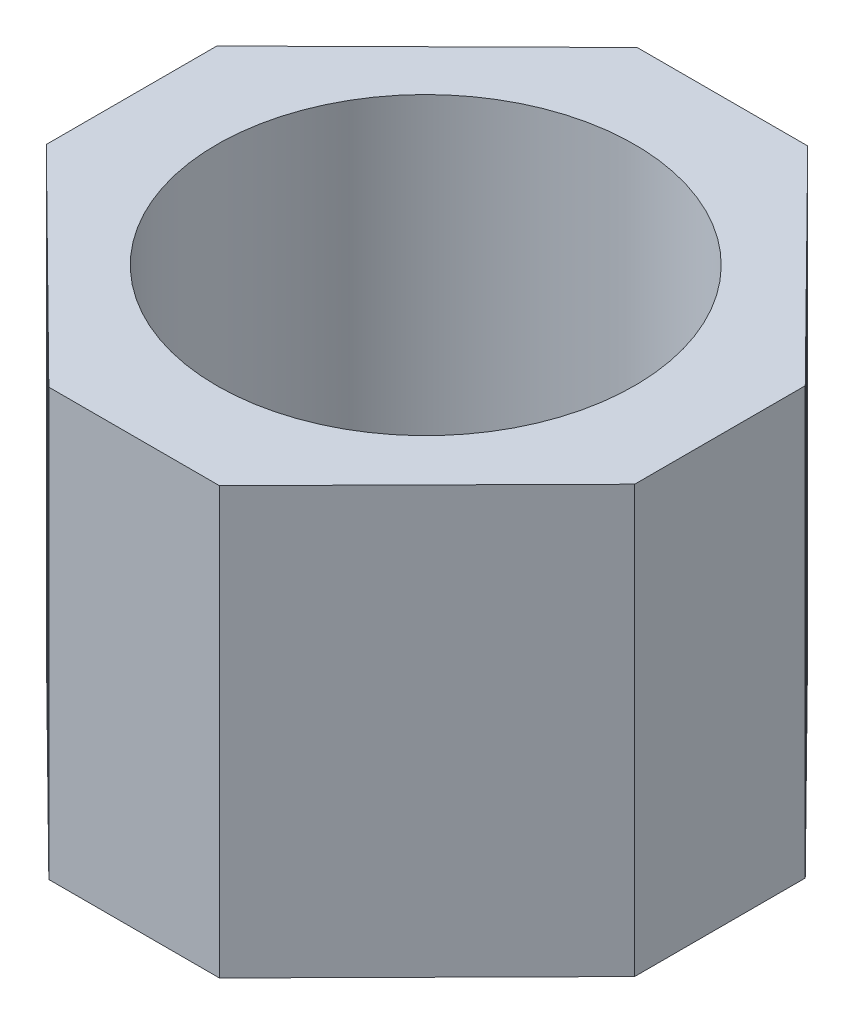
ISO-10303-21;
HEADER;
FILE_DESCRIPTION(('STEP AP214'),'2;1');
FILE_NAME('part.step','',(''),(''),'','','');
FILE_SCHEMA(('AUTOMOTIVE_DESIGN { 1 0 10303 214 1 1 1 1 }'));
ENDSEC;
DATA;
#1=APPLICATION_CONTEXT('core data for automotive mechanical design processes');
#2=APPLICATION_PROTOCOL_DEFINITION('international standard','automotive_design',2000,#1);
#3=PRODUCT_CONTEXT('',#1,'mechanical');
#4=PRODUCT('Part','Part','',(#3));
#5=PRODUCT_RELATED_PRODUCT_CATEGORY('part','',(#4));
#6=PRODUCT_DEFINITION_FORMATION('','',#4);
#7=PRODUCT_DEFINITION_CONTEXT('part definition',#1,'design');
#8=PRODUCT_DEFINITION('design','',#6,#7);
#9=PRODUCT_DEFINITION_SHAPE('','',#8);
#10=(LENGTH_UNIT() NAMED_UNIT(*) SI_UNIT(.MILLI.,.METRE.));
#11=(NAMED_UNIT(*) PLANE_ANGLE_UNIT() SI_UNIT($,.RADIAN.));
#12=(NAMED_UNIT(*) SI_UNIT($,.STERADIAN.) SOLID_ANGLE_UNIT());
#13=UNCERTAINTY_MEASURE_WITH_UNIT(LENGTH_MEASURE(1.E-05),#10,'distance_accuracy_value','');
#14=(GEOMETRIC_REPRESENTATION_CONTEXT(3) GLOBAL_UNCERTAINTY_ASSIGNED_CONTEXT((#13)) GLOBAL_UNIT_ASSIGNED_CONTEXT((#10,
#11,#12)) REPRESENTATION_CONTEXT('',''));
#15=CARTESIAN_POINT('',(0.,0.,0.));
#16=DIRECTION('',(0.,0.,1.));
#17=DIRECTION('',(1.,0.,0.));
#18=AXIS2_PLACEMENT_3D('',#15,#16,#17);
#19=CARTESIAN_POINT('',(3.45,5.,0.));
#20=DIRECTION('',(-1.,0.,0.));
#21=DIRECTION('',(0.,0.,1.));
#22=AXIS2_PLACEMENT_3D('',#19,#20,#21);
#23=PLANE('',#22);
#24=DIRECTION('',(0.,0.,-1.));
#25=VECTOR('',#24,1.);
#26=CARTESIAN_POINT('',(3.45,0.,0.));
#27=LINE('',#26,#25);
#28=CARTESIAN_POINT('',(3.45,0.,1.));
#29=VERTEX_POINT('',#28);
#30=CARTESIAN_POINT('',(3.45,0.,-1.));
#31=VERTEX_POINT('',#30);
#32=EDGE_CURVE('E134',#29,#31,#27,.T.);
#33=ORIENTED_EDGE('',*,*,#32,.T.);
#34=DIRECTION('',(0.,-1.,0.));
#35=VECTOR('',#34,1.);
#36=CARTESIAN_POINT('',(3.45,5.,-1.));
#37=LINE('',#36,#35);
#38=CARTESIAN_POINT('',(3.45,5.,-1.));
#39=VERTEX_POINT('',#38);
#40=EDGE_CURVE('E11',#39,#31,#37,.T.);
#41=ORIENTED_EDGE('',*,*,#40,.F.);
#42=DIRECTION('',(0.,0.,-1.));
#43=VECTOR('',#42,1.);
#44=CARTESIAN_POINT('',(3.45,5.,0.));
#45=LINE('',#44,#43);
#46=CARTESIAN_POINT('',(3.45,5.,1.));
#47=VERTEX_POINT('',#46);
#48=EDGE_CURVE('E183',#47,#39,#45,.T.);
#49=ORIENTED_EDGE('',*,*,#48,.F.);
#50=DIRECTION('',(0.,-1.,0.));
#51=VECTOR('',#50,1.);
#52=CARTESIAN_POINT('',(3.45,5.,1.));
#53=LINE('',#52,#51);
#54=EDGE_CURVE('E127',#47,#29,#53,.T.);
#55=ORIENTED_EDGE('',*,*,#54,.T.);
#56=EDGE_LOOP('',(#33,#41,#49,#55));
#57=FACE_BOUND('',#56,.T.);
#58=ADVANCED_FACE('F35',(#57),#23,.F.);
#59=CARTESIAN_POINT('',(2.24576253721168,5.,-2.21884594418373));
#60=DIRECTION('',(-0.711356915918418,0.,0.702830945658369));
#61=DIRECTION('',(0.702830945658369,0.,0.711356915918418));
#62=AXIS2_PLACEMENT_3D('',#59,#60,#61);
#63=PLANE('',#62);
#64=DIRECTION('',(-0.702830945658369,0.,-0.711356915918418));
#65=VECTOR('',#64,1.);
#66=CARTESIAN_POINT('',(2.24576253721168,0.,-2.21884594418373));
#67=LINE('',#66,#65);
#68=CARTESIAN_POINT('',(1.02980337680468,0.,-3.44955578070013));
#69=VERTEX_POINT('',#68);
#70=EDGE_CURVE('E137',#31,#69,#67,.T.);
#71=ORIENTED_EDGE('',*,*,#70,.T.);
#72=DIRECTION('',(0.,-1.,0.));
#73=VECTOR('',#72,1.);
#74=CARTESIAN_POINT('',(1.02980337680468,5.,-3.44955578070013));
#75=LINE('',#74,#73);
#76=CARTESIAN_POINT('',(1.02980337680468,5.,-3.44955578070013));
#77=VERTEX_POINT('',#76);
#78=EDGE_CURVE('E44',#77,#69,#75,.T.);
#79=ORIENTED_EDGE('',*,*,#78,.F.);
#80=DIRECTION('',(-0.702830945658369,0.,-0.711356915918418));
#81=VECTOR('',#80,1.);
#82=CARTESIAN_POINT('',(2.24576253721168,5.,-2.21884594418373));
#83=LINE('',#82,#81);
#84=EDGE_CURVE('E91',#39,#77,#83,.T.);
#85=ORIENTED_EDGE('',*,*,#84,.F.);
#86=ORIENTED_EDGE('',*,*,#40,.T.);
#87=EDGE_LOOP('',(#71,#79,#85,#86));
#88=FACE_BOUND('',#87,.T.);
#89=ADVANCED_FACE('F165',(#88),#63,.F.);
#90=CARTESIAN_POINT('',(0.,5.,-3.44955578070013));
#91=DIRECTION('',(0.,0.,-1.));
#92=DIRECTION('',(-1.,0.,0.));
#93=AXIS2_PLACEMENT_3D('',#90,#91,#92);
#94=PLANE('',#93);
#95=DIRECTION('',(1.,0.,0.));
#96=VECTOR('',#95,1.);
#97=CARTESIAN_POINT('',(0.,0.,-3.44955578070013));
#98=LINE('',#97,#96);
#99=CARTESIAN_POINT('',(-0.970196623195322,0.,-3.44955578070013));
#100=VERTEX_POINT('',#99);
#101=EDGE_CURVE('E140',#100,#69,#98,.T.);
#102=ORIENTED_EDGE('',*,*,#101,.F.);
#103=DIRECTION('',(0.,-1.,0.));
#104=VECTOR('',#103,1.);
#105=CARTESIAN_POINT('',(-0.970196623195322,5.,-3.44955578070013));
#106=LINE('',#105,#104);
#107=CARTESIAN_POINT('',(-0.970196623195322,5.,-3.44955578070013));
#108=VERTEX_POINT('',#107);
#109=EDGE_CURVE('E158',#108,#100,#106,.T.);
#110=ORIENTED_EDGE('',*,*,#109,.F.);
#111=DIRECTION('',(1.,0.,0.));
#112=VECTOR('',#111,1.);
#113=CARTESIAN_POINT('',(0.,5.,-3.44955578070013));
#114=LINE('',#113,#112);
#115=EDGE_CURVE('E164',#108,#77,#114,.T.);
#116=ORIENTED_EDGE('',*,*,#115,.T.);
#117=ORIENTED_EDGE('',*,*,#78,.T.);
#118=EDGE_LOOP('',(#102,#110,#116,#117));
#119=FACE_BOUND('',#118,.T.);
#120=ADVANCED_FACE('F162',(#119),#94,.T.);
#121=CARTESIAN_POINT('',(-2.20379321169294,5.,-2.23100608330438));
#122=DIRECTION('',(0.702754593276589,0.,0.711432345081847));
#123=DIRECTION('',(0.711432345081847,0.,-0.702754593276589));
#124=AXIS2_PLACEMENT_3D('',#121,#122,#123);
#125=PLANE('',#124);
#126=DIRECTION('',(-0.711432345081847,0.,0.702754593276589));
#127=VECTOR('',#126,1.);
#128=CARTESIAN_POINT('',(-2.20379321169294,0.,-2.23100608330438));
#129=LINE('',#128,#127);
#130=CARTESIAN_POINT('',(-3.45,0.,-1.));
#131=VERTEX_POINT('',#130);
#132=EDGE_CURVE('E143',#100,#131,#129,.T.);
#133=ORIENTED_EDGE('',*,*,#132,.T.);
#134=DIRECTION('',(0.,-1.,0.));
#135=VECTOR('',#134,1.);
#136=CARTESIAN_POINT('',(-3.45,5.,-1.));
#137=LINE('',#136,#135);
#138=CARTESIAN_POINT('',(-3.45,5.,-1.));
#139=VERTEX_POINT('',#138);
#140=EDGE_CURVE('E155',#139,#131,#137,.T.);
#141=ORIENTED_EDGE('',*,*,#140,.F.);
#142=DIRECTION('',(-0.711432345081847,0.,0.702754593276589));
#143=VECTOR('',#142,1.);
#144=CARTESIAN_POINT('',(-2.20379321169294,5.,-2.23100608330438));
#145=LINE('',#144,#143);
#146=EDGE_CURVE('E178',#108,#139,#145,.T.);
#147=ORIENTED_EDGE('',*,*,#146,.F.);
#148=ORIENTED_EDGE('',*,*,#109,.T.);
#149=EDGE_LOOP('',(#133,#141,#147,#148));
#150=FACE_BOUND('',#149,.T.);
#151=ADVANCED_FACE('F174',(#150),#125,.F.);
#152=CARTESIAN_POINT('',(-3.45,5.,0.));
#153=DIRECTION('',(1.,0.,0.));
#154=DIRECTION('',(0.,0.,-1.));
#155=AXIS2_PLACEMENT_3D('',#152,#153,#154);
#156=PLANE('',#155);
#157=DIRECTION('',(0.,0.,1.));
#158=VECTOR('',#157,1.);
#159=CARTESIAN_POINT('',(-3.45,0.,0.));
#160=LINE('',#159,#158);
#161=CARTESIAN_POINT('',(-3.45,0.,1.));
#162=VERTEX_POINT('',#161);
#163=EDGE_CURVE('E145',#131,#162,#160,.T.);
#164=ORIENTED_EDGE('',*,*,#163,.T.);
#165=DIRECTION('',(0.,-1.,0.));
#166=VECTOR('',#165,1.);
#167=CARTESIAN_POINT('',(-3.45,5.,1.));
#168=LINE('',#167,#166);
#169=CARTESIAN_POINT('',(-3.45,5.,1.));
#170=VERTEX_POINT('',#169);
#171=EDGE_CURVE('E123',#170,#162,#168,.T.);
#172=ORIENTED_EDGE('',*,*,#171,.F.);
#173=DIRECTION('',(0.,0.,1.));
#174=VECTOR('',#173,1.);
#175=CARTESIAN_POINT('',(-3.45,5.,0.));
#176=LINE('',#175,#174);
#177=EDGE_CURVE('E110',#139,#170,#176,.T.);
#178=ORIENTED_EDGE('',*,*,#177,.F.);
#179=ORIENTED_EDGE('',*,*,#140,.T.);
#180=EDGE_LOOP('',(#164,#172,#178,#179));
#181=FACE_BOUND('',#180,.T.);
#182=ADVANCED_FACE('F177',(#181),#156,.F.);
#183=CARTESIAN_POINT('',(-2.20379321169294,5.,2.23100608330438));
#184=DIRECTION('',(0.702754593276589,0.,-0.711432345081847));
#185=DIRECTION('',(-0.711432345081847,0.,-0.702754593276589));
#186=AXIS2_PLACEMENT_3D('',#183,#184,#185);
#187=PLANE('',#186);
#188=DIRECTION('',(0.711432345081847,0.,0.702754593276589));
#189=VECTOR('',#188,1.);
#190=CARTESIAN_POINT('',(-2.20379321169294,0.,2.23100608330438));
#191=LINE('',#190,#189);
#192=CARTESIAN_POINT('',(-0.970196623195322,0.,3.44955578070013));
#193=VERTEX_POINT('',#192);
#194=EDGE_CURVE('E119',#162,#193,#191,.T.);
#195=ORIENTED_EDGE('',*,*,#194,.T.);
#196=DIRECTION('',(0.,-1.,0.));
#197=VECTOR('',#196,1.);
#198=CARTESIAN_POINT('',(-0.970196623195322,5.,3.44955578070013));
#199=LINE('',#198,#197);
#200=CARTESIAN_POINT('',(-0.970196623195322,5.,3.44955578070013));
#201=VERTEX_POINT('',#200);
#202=EDGE_CURVE('E116',#201,#193,#199,.T.);
#203=ORIENTED_EDGE('',*,*,#202,.F.);
#204=DIRECTION('',(0.711432345081847,0.,0.702754593276589));
#205=VECTOR('',#204,1.);
#206=CARTESIAN_POINT('',(-2.20379321169294,5.,2.23100608330438));
#207=LINE('',#206,#205);
#208=EDGE_CURVE('E104',#170,#201,#207,.T.);
#209=ORIENTED_EDGE('',*,*,#208,.F.);
#210=ORIENTED_EDGE('',*,*,#171,.T.);
#211=EDGE_LOOP('',(#195,#203,#209,#210));
#212=FACE_BOUND('',#211,.T.);
#213=ADVANCED_FACE('F117',(#212),#187,.F.);
#214=CARTESIAN_POINT('',(0.,5.,3.44955578070013));
#215=DIRECTION('',(0.,0.,1.));
#216=DIRECTION('',(1.,0.,0.));
#217=AXIS2_PLACEMENT_3D('',#214,#215,#216);
#218=PLANE('',#217);
#219=DIRECTION('',(-1.,0.,0.));
#220=VECTOR('',#219,1.);
#221=CARTESIAN_POINT('',(0.,0.,3.44955578070013));
#222=LINE('',#221,#220);
#223=CARTESIAN_POINT('',(1.02980337680468,0.,3.44955578070013));
#224=VERTEX_POINT('',#223);
#225=EDGE_CURVE('E148',#224,#193,#222,.T.);
#226=ORIENTED_EDGE('',*,*,#225,.F.);
#227=DIRECTION('',(0.,-1.,0.));
#228=VECTOR('',#227,1.);
#229=CARTESIAN_POINT('',(1.02980337680468,5.,3.44955578070013));
#230=LINE('',#229,#228);
#231=CARTESIAN_POINT('',(1.02980337680468,5.,3.44955578070013));
#232=VERTEX_POINT('',#231);
#233=EDGE_CURVE('E80',#232,#224,#230,.T.);
#234=ORIENTED_EDGE('',*,*,#233,.F.);
#235=DIRECTION('',(-1.,0.,0.));
#236=VECTOR('',#235,1.);
#237=CARTESIAN_POINT('',(0.,5.,3.44955578070013));
#238=LINE('',#237,#236);
#239=EDGE_CURVE('E108',#232,#201,#238,.T.);
#240=ORIENTED_EDGE('',*,*,#239,.T.);
#241=ORIENTED_EDGE('',*,*,#202,.T.);
#242=EDGE_LOOP('',(#226,#234,#240,#241));
#243=FACE_BOUND('',#242,.T.);
#244=ADVANCED_FACE('F125',(#243),#218,.T.);
#245=CARTESIAN_POINT('',(0.,5.,0.));
#246=DIRECTION('',(0.,-1.,0.));
#247=DIRECTION('',(0.,0.,-1.));
#248=AXIS2_PLACEMENT_3D('',#245,#246,#247);
#249=CYLINDRICAL_SURFACE('',#248,2.45);
#250=CARTESIAN_POINT('',(0.,5.,0.));
#251=DIRECTION('',(0.,1.,0.));
#252=DIRECTION('',(0.,0.,1.));
#253=AXIS2_PLACEMENT_3D('',#250,#251,#252);
#254=CIRCLE('',#253,2.45);
#255=CARTESIAN_POINT('',(0.,5.,2.45));
#256=VERTEX_POINT('',#255);
#257=EDGE_CURVE('E151',#256,#256,#254,.T.);
#258=ORIENTED_EDGE('',*,*,#257,.T.);
#259=EDGE_LOOP('',(#258));
#260=FACE_BOUND('',#259,.T.);
#261=CARTESIAN_POINT('',(0.,0.,0.));
#262=DIRECTION('',(0.,1.,0.));
#263=DIRECTION('',(0.,0.,1.));
#264=AXIS2_PLACEMENT_3D('',#261,#262,#263);
#265=CIRCLE('',#264,2.45);
#266=CARTESIAN_POINT('',(0.,0.,2.45));
#267=VERTEX_POINT('',#266);
#268=EDGE_CURVE('E131',#267,#267,#265,.T.);
#269=ORIENTED_EDGE('',*,*,#268,.F.);
#270=EDGE_LOOP('',(#269));
#271=FACE_BOUND('',#270,.T.);
#272=ADVANCED_FACE('F37',(#260,#271),#249,.F.);
#273=CARTESIAN_POINT('',(2.24576253721169,5.,2.21884594418373));
#274=DIRECTION('',(-0.711356915918418,0.,-0.702830945658369));
#275=DIRECTION('',(-0.702830945658369,0.,0.711356915918418));
#276=AXIS2_PLACEMENT_3D('',#273,#274,#275);
#277=PLANE('',#276);
#278=DIRECTION('',(0.702830945658369,0.,-0.711356915918418));
#279=VECTOR('',#278,1.);
#280=CARTESIAN_POINT('',(2.24576253721169,0.,2.21884594418373));
#281=LINE('',#280,#279);
#282=EDGE_CURVE('E83',#224,#29,#281,.T.);
#283=ORIENTED_EDGE('',*,*,#282,.T.);
#284=ORIENTED_EDGE('',*,*,#54,.F.);
#285=DIRECTION('',(0.702830945658369,0.,-0.711356915918418));
#286=VECTOR('',#285,1.);
#287=CARTESIAN_POINT('',(2.24576253721169,5.,2.21884594418373));
#288=LINE('',#287,#286);
#289=EDGE_CURVE('E52',#232,#47,#288,.T.);
#290=ORIENTED_EDGE('',*,*,#289,.F.);
#291=ORIENTED_EDGE('',*,*,#233,.T.);
#292=EDGE_LOOP('',(#283,#284,#290,#291));
#293=FACE_BOUND('',#292,.T.);
#294=ADVANCED_FACE('F191',(#293),#277,.F.);
#295=CARTESIAN_POINT('',(0.,5.,0.));
#296=DIRECTION('',(0.,1.,0.));
#297=DIRECTION('',(0.,0.,1.));
#298=AXIS2_PLACEMENT_3D('',#295,#296,#297);
#299=PLANE('',#298);
#300=ORIENTED_EDGE('',*,*,#257,.F.);
#301=EDGE_LOOP('',(#300));
#302=FACE_BOUND('',#301,.T.);
#303=ORIENTED_EDGE('',*,*,#48,.T.);
#304=ORIENTED_EDGE('',*,*,#84,.T.);
#305=ORIENTED_EDGE('',*,*,#115,.F.);
#306=ORIENTED_EDGE('',*,*,#146,.T.);
#307=ORIENTED_EDGE('',*,*,#177,.T.);
#308=ORIENTED_EDGE('',*,*,#208,.T.);
#309=ORIENTED_EDGE('',*,*,#239,.F.);
#310=ORIENTED_EDGE('',*,*,#289,.T.);
#311=EDGE_LOOP('',(#303,#304,#305,#306,#307,#308,#309,#310));
#312=FACE_BOUND('',#311,.T.);
#313=ADVANCED_FACE('F106',(#302,#312),#299,.T.);
#314=CARTESIAN_POINT('',(0.,0.,0.));
#315=DIRECTION('',(0.,1.,0.));
#316=DIRECTION('',(0.,0.,1.));
#317=AXIS2_PLACEMENT_3D('',#314,#315,#316);
#318=PLANE('',#317);
#319=ORIENTED_EDGE('',*,*,#268,.T.);
#320=EDGE_LOOP('',(#319));
#321=FACE_BOUND('',#320,.T.);
#322=ORIENTED_EDGE('',*,*,#32,.F.);
#323=ORIENTED_EDGE('',*,*,#282,.F.);
#324=ORIENTED_EDGE('',*,*,#225,.T.);
#325=ORIENTED_EDGE('',*,*,#194,.F.);
#326=ORIENTED_EDGE('',*,*,#163,.F.);
#327=ORIENTED_EDGE('',*,*,#132,.F.);
#328=ORIENTED_EDGE('',*,*,#101,.T.);
#329=ORIENTED_EDGE('',*,*,#70,.F.);
#330=EDGE_LOOP('',(#322,#323,#324,#325,#326,#327,#328,#329));
#331=FACE_BOUND('',#330,.T.);
#332=ADVANCED_FACE('F170',(#321,#331),#318,.F.);
#333=CLOSED_SHELL('',(#58,#89,#120,#151,#182,#213,#244,#272,#294,#313,#332));
#334=MANIFOLD_SOLID_BREP('B2',#333);
#335=ADVANCED_BREP_SHAPE_REPRESENTATION('',(#18,#334),#14);
#336=SHAPE_DEFINITION_REPRESENTATION(#9,#335);
ENDSEC;
END-ISO-10303-21;
